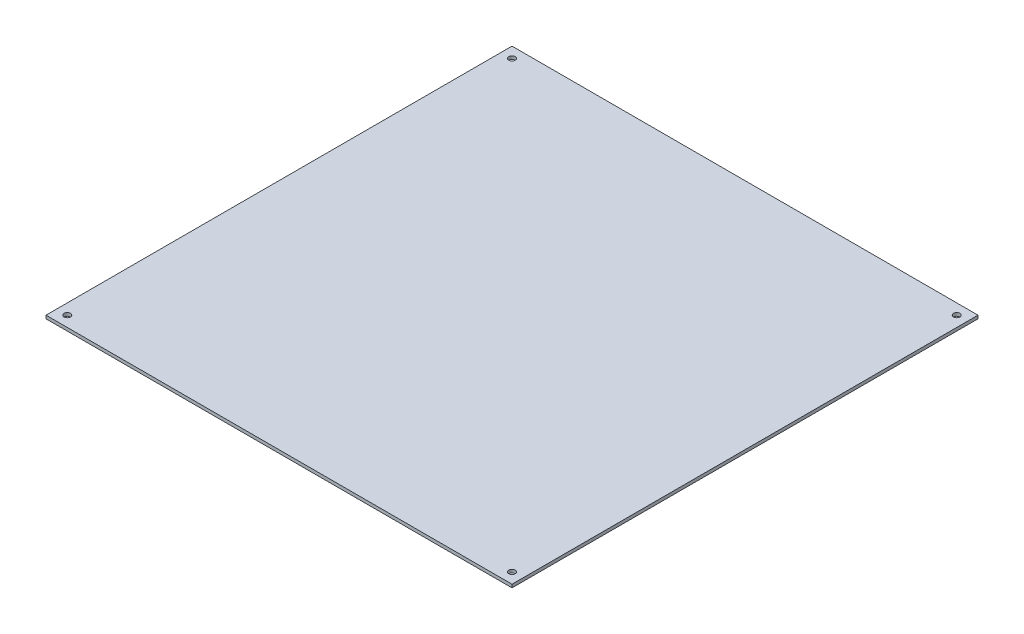
ISO-10303-21;
HEADER;
FILE_DESCRIPTION(('STEP AP214'),'2;1');
FILE_NAME('part.step','',(''),(''),'','','');
FILE_SCHEMA(('AUTOMOTIVE_DESIGN { 1 0 10303 214 1 1 1 1 }'));
ENDSEC;
DATA;
#1=APPLICATION_CONTEXT('core data for automotive mechanical design processes');
#2=APPLICATION_PROTOCOL_DEFINITION('international standard','automotive_design',2000,#1);
#3=PRODUCT_CONTEXT('',#1,'mechanical');
#4=PRODUCT('Part','Part','',(#3));
#5=PRODUCT_RELATED_PRODUCT_CATEGORY('part','',(#4));
#6=PRODUCT_DEFINITION_FORMATION('','',#4);
#7=PRODUCT_DEFINITION_CONTEXT('part definition',#1,'design');
#8=PRODUCT_DEFINITION('design','',#6,#7);
#9=PRODUCT_DEFINITION_SHAPE('','',#8);
#10=(LENGTH_UNIT() NAMED_UNIT(*) SI_UNIT(.MILLI.,.METRE.));
#11=(NAMED_UNIT(*) PLANE_ANGLE_UNIT() SI_UNIT($,.RADIAN.));
#12=(NAMED_UNIT(*) SI_UNIT($,.STERADIAN.) SOLID_ANGLE_UNIT());
#13=UNCERTAINTY_MEASURE_WITH_UNIT(LENGTH_MEASURE(1.E-05),#10,'distance_accuracy_value','');
#14=(GEOMETRIC_REPRESENTATION_CONTEXT(3) GLOBAL_UNCERTAINTY_ASSIGNED_CONTEXT((#13)) GLOBAL_UNIT_ASSIGNED_CONTEXT((#10,
#11,#12)) REPRESENTATION_CONTEXT('',''));
#15=CARTESIAN_POINT('',(0.,0.,0.));
#16=DIRECTION('',(0.,0.,1.));
#17=DIRECTION('',(1.,0.,0.));
#18=AXIS2_PLACEMENT_3D('',#15,#16,#17);
#19=CARTESIAN_POINT('',(0.,1.5,0.));
#20=DIRECTION('',(0.,1.,0.));
#21=DIRECTION('',(0.,0.,1.));
#22=AXIS2_PLACEMENT_3D('',#19,#20,#21);
#23=PLANE('',#22);
#24=CARTESIAN_POINT('',(-5.,1.5,-5.00000000000003));
#25=DIRECTION('',(0.,1.,0.));
#26=DIRECTION('',(0.,0.,1.));
#27=AXIS2_PLACEMENT_3D('',#24,#25,#26);
#28=CIRCLE('',#27,1.5);
#29=CARTESIAN_POINT('',(-5.,1.5,-3.50000000000003));
#30=VERTEX_POINT('',#29);
#31=EDGE_CURVE('E122',#30,#30,#28,.T.);
#32=ORIENTED_EDGE('',*,*,#31,.F.);
#33=EDGE_LOOP('',(#32));
#34=FACE_BOUND('',#33,.T.);
#35=CARTESIAN_POINT('',(-214.,1.5,-214.));
#36=DIRECTION('',(0.,1.,0.));
#37=DIRECTION('',(0.,0.,1.));
#38=AXIS2_PLACEMENT_3D('',#35,#36,#37);
#39=CIRCLE('',#38,1.5);
#40=CARTESIAN_POINT('',(-214.,1.5,-212.5));
#41=VERTEX_POINT('',#40);
#42=EDGE_CURVE('E101',#41,#41,#39,.T.);
#43=ORIENTED_EDGE('',*,*,#42,.F.);
#44=EDGE_LOOP('',(#43));
#45=FACE_BOUND('',#44,.T.);
#46=DIRECTION('',(0.,0.,1.));
#47=VECTOR('',#46,1.);
#48=CARTESIAN_POINT('',(-219.,1.5,-219.));
#49=LINE('',#48,#47);
#50=CARTESIAN_POINT('',(-219.,1.5,-219.));
#51=VERTEX_POINT('',#50);
#52=CARTESIAN_POINT('',(-219.,1.5,0.));
#53=VERTEX_POINT('',#52);
#54=EDGE_CURVE('E86',#51,#53,#49,.T.);
#55=ORIENTED_EDGE('',*,*,#54,.T.);
#56=DIRECTION('',(1.,0.,0.));
#57=VECTOR('',#56,1.);
#58=CARTESIAN_POINT('',(-219.,1.5,0.));
#59=LINE('',#58,#57);
#60=CARTESIAN_POINT('',(0.,1.5,0.));
#61=VERTEX_POINT('',#60);
#62=EDGE_CURVE('E81',#53,#61,#59,.T.);
#63=ORIENTED_EDGE('',*,*,#62,.T.);
#64=DIRECTION('',(0.,0.,-1.));
#65=VECTOR('',#64,1.);
#66=CARTESIAN_POINT('',(0.,1.5,-219.));
#67=LINE('',#66,#65);
#68=CARTESIAN_POINT('',(0.,1.5,-219.));
#69=VERTEX_POINT('',#68);
#70=EDGE_CURVE('E84',#61,#69,#67,.T.);
#71=ORIENTED_EDGE('',*,*,#70,.T.);
#72=DIRECTION('',(-1.,0.,0.));
#73=VECTOR('',#72,1.);
#74=CARTESIAN_POINT('',(-219.,1.5,-219.));
#75=LINE('',#74,#73);
#76=EDGE_CURVE('E51',#69,#51,#75,.T.);
#77=ORIENTED_EDGE('',*,*,#76,.T.);
#78=EDGE_LOOP('',(#55,#63,#71,#77));
#79=FACE_BOUND('',#78,.T.);
#80=CARTESIAN_POINT('',(-214.,1.5,-5.));
#81=DIRECTION('',(0.,1.,0.));
#82=DIRECTION('',(0.,0.,1.));
#83=AXIS2_PLACEMENT_3D('',#80,#81,#82);
#84=CIRCLE('',#83,1.5);
#85=CARTESIAN_POINT('',(-214.,1.5,-3.50000000000001));
#86=VERTEX_POINT('',#85);
#87=EDGE_CURVE('E116',#86,#86,#84,.T.);
#88=ORIENTED_EDGE('',*,*,#87,.F.);
#89=EDGE_LOOP('',(#88));
#90=FACE_BOUND('',#89,.T.);
#91=CARTESIAN_POINT('',(-5.00000000000006,1.5,-214.));
#92=DIRECTION('',(0.,1.,0.));
#93=DIRECTION('',(0.,0.,1.));
#94=AXIS2_PLACEMENT_3D('',#91,#92,#93);
#95=CIRCLE('',#94,1.5);
#96=CARTESIAN_POINT('',(-5.00000000000006,1.5,-212.5));
#97=VERTEX_POINT('',#96);
#98=EDGE_CURVE('E128',#97,#97,#95,.T.);
#99=ORIENTED_EDGE('',*,*,#98,.F.);
#100=EDGE_LOOP('',(#99));
#101=FACE_BOUND('',#100,.T.);
#102=ADVANCED_FACE('F34',(#34,#45,#79,#90,#101),#23,.T.);
#103=CARTESIAN_POINT('',(0.,0.,0.));
#104=DIRECTION('',(0.,1.,0.));
#105=DIRECTION('',(0.,0.,1.));
#106=AXIS2_PLACEMENT_3D('',#103,#104,#105);
#107=PLANE('',#106);
#108=DIRECTION('',(0.,0.,1.));
#109=VECTOR('',#108,1.);
#110=CARTESIAN_POINT('',(-219.,0.,-219.));
#111=LINE('',#110,#109);
#112=CARTESIAN_POINT('',(-219.,0.,-219.));
#113=VERTEX_POINT('',#112);
#114=CARTESIAN_POINT('',(-219.,0.,0.));
#115=VERTEX_POINT('',#114);
#116=EDGE_CURVE('E98',#113,#115,#111,.T.);
#117=ORIENTED_EDGE('',*,*,#116,.F.);
#118=DIRECTION('',(-1.,0.,0.));
#119=VECTOR('',#118,1.);
#120=CARTESIAN_POINT('',(-219.,0.,-219.));
#121=LINE('',#120,#119);
#122=CARTESIAN_POINT('',(0.,0.,-219.));
#123=VERTEX_POINT('',#122);
#124=EDGE_CURVE('E74',#123,#113,#121,.T.);
#125=ORIENTED_EDGE('',*,*,#124,.F.);
#126=DIRECTION('',(0.,0.,-1.));
#127=VECTOR('',#126,1.);
#128=CARTESIAN_POINT('',(0.,0.,-219.));
#129=LINE('',#128,#127);
#130=CARTESIAN_POINT('',(0.,0.,0.));
#131=VERTEX_POINT('',#130);
#132=EDGE_CURVE('E68',#131,#123,#129,.T.);
#133=ORIENTED_EDGE('',*,*,#132,.F.);
#134=DIRECTION('',(1.,0.,0.));
#135=VECTOR('',#134,1.);
#136=CARTESIAN_POINT('',(-219.,0.,0.));
#137=LINE('',#136,#135);
#138=EDGE_CURVE('E90',#115,#131,#137,.T.);
#139=ORIENTED_EDGE('',*,*,#138,.F.);
#140=EDGE_LOOP('',(#117,#125,#133,#139));
#141=FACE_BOUND('',#140,.T.);
#142=CARTESIAN_POINT('',(-214.,0.,-214.));
#143=DIRECTION('',(0.,1.,0.));
#144=DIRECTION('',(0.,0.,1.));
#145=AXIS2_PLACEMENT_3D('',#142,#143,#144);
#146=CIRCLE('',#145,1.5);
#147=CARTESIAN_POINT('',(-214.,0.,-212.5));
#148=VERTEX_POINT('',#147);
#149=EDGE_CURVE('E113',#148,#148,#146,.T.);
#150=ORIENTED_EDGE('',*,*,#149,.T.);
#151=EDGE_LOOP('',(#150));
#152=FACE_BOUND('',#151,.T.);
#153=CARTESIAN_POINT('',(-214.,0.,-5.));
#154=DIRECTION('',(0.,1.,0.));
#155=DIRECTION('',(0.,0.,1.));
#156=AXIS2_PLACEMENT_3D('',#153,#154,#155);
#157=CIRCLE('',#156,1.5);
#158=CARTESIAN_POINT('',(-214.,0.,-3.50000000000001));
#159=VERTEX_POINT('',#158);
#160=EDGE_CURVE('E119',#159,#159,#157,.T.);
#161=ORIENTED_EDGE('',*,*,#160,.T.);
#162=EDGE_LOOP('',(#161));
#163=FACE_BOUND('',#162,.T.);
#164=CARTESIAN_POINT('',(-5.,0.,-5.00000000000003));
#165=DIRECTION('',(0.,1.,0.));
#166=DIRECTION('',(0.,0.,1.));
#167=AXIS2_PLACEMENT_3D('',#164,#165,#166);
#168=CIRCLE('',#167,1.5);
#169=CARTESIAN_POINT('',(-5.,0.,-3.50000000000003));
#170=VERTEX_POINT('',#169);
#171=EDGE_CURVE('E125',#170,#170,#168,.T.);
#172=ORIENTED_EDGE('',*,*,#171,.T.);
#173=EDGE_LOOP('',(#172));
#174=FACE_BOUND('',#173,.T.);
#175=CARTESIAN_POINT('',(-5.00000000000006,0.,-214.));
#176=DIRECTION('',(0.,1.,0.));
#177=DIRECTION('',(0.,0.,1.));
#178=AXIS2_PLACEMENT_3D('',#175,#176,#177);
#179=CIRCLE('',#178,1.5);
#180=CARTESIAN_POINT('',(-5.00000000000006,0.,-212.5));
#181=VERTEX_POINT('',#180);
#182=EDGE_CURVE('E131',#181,#181,#179,.T.);
#183=ORIENTED_EDGE('',*,*,#182,.T.);
#184=EDGE_LOOP('',(#183));
#185=FACE_BOUND('',#184,.T.);
#186=ADVANCED_FACE('F109',(#141,#152,#163,#174,#185),#107,.F.);
#187=CARTESIAN_POINT('',(-219.,1.5,-219.));
#188=DIRECTION('',(1.,0.,0.));
#189=DIRECTION('',(0.,0.,-1.));
#190=AXIS2_PLACEMENT_3D('',#187,#188,#189);
#191=PLANE('',#190);
#192=ORIENTED_EDGE('',*,*,#116,.T.);
#193=DIRECTION('',(0.,-1.,0.));
#194=VECTOR('',#193,1.);
#195=CARTESIAN_POINT('',(-219.,1.5,0.));
#196=LINE('',#195,#194);
#197=EDGE_CURVE('E11',#53,#115,#196,.T.);
#198=ORIENTED_EDGE('',*,*,#197,.F.);
#199=ORIENTED_EDGE('',*,*,#54,.F.);
#200=DIRECTION('',(0.,-1.,0.));
#201=VECTOR('',#200,1.);
#202=CARTESIAN_POINT('',(-219.,1.5,-219.));
#203=LINE('',#202,#201);
#204=EDGE_CURVE('E94',#51,#113,#203,.T.);
#205=ORIENTED_EDGE('',*,*,#204,.T.);
#206=EDGE_LOOP('',(#192,#198,#199,#205));
#207=FACE_BOUND('',#206,.T.);
#208=ADVANCED_FACE('F36',(#207),#191,.F.);
#209=CARTESIAN_POINT('',(-219.,1.5,0.));
#210=DIRECTION('',(0.,0.,-1.));
#211=DIRECTION('',(-1.,0.,0.));
#212=AXIS2_PLACEMENT_3D('',#209,#210,#211);
#213=PLANE('',#212);
#214=ORIENTED_EDGE('',*,*,#138,.T.);
#215=DIRECTION('',(0.,-1.,0.));
#216=VECTOR('',#215,1.);
#217=CARTESIAN_POINT('',(0.,1.5,0.));
#218=LINE('',#217,#216);
#219=EDGE_CURVE('E43',#61,#131,#218,.T.);
#220=ORIENTED_EDGE('',*,*,#219,.F.);
#221=ORIENTED_EDGE('',*,*,#62,.F.);
#222=ORIENTED_EDGE('',*,*,#197,.T.);
#223=EDGE_LOOP('',(#214,#220,#221,#222));
#224=FACE_BOUND('',#223,.T.);
#225=ADVANCED_FACE('F89',(#224),#213,.F.);
#226=CARTESIAN_POINT('',(0.,1.5,-219.));
#227=DIRECTION('',(-1.,0.,0.));
#228=DIRECTION('',(0.,0.,1.));
#229=AXIS2_PLACEMENT_3D('',#226,#227,#228);
#230=PLANE('',#229);
#231=ORIENTED_EDGE('',*,*,#132,.T.);
#232=DIRECTION('',(0.,-1.,0.));
#233=VECTOR('',#232,1.);
#234=CARTESIAN_POINT('',(0.,1.5,-219.));
#235=LINE('',#234,#233);
#236=EDGE_CURVE('E91',#69,#123,#235,.T.);
#237=ORIENTED_EDGE('',*,*,#236,.F.);
#238=ORIENTED_EDGE('',*,*,#70,.F.);
#239=ORIENTED_EDGE('',*,*,#219,.T.);
#240=EDGE_LOOP('',(#231,#237,#238,#239));
#241=FACE_BOUND('',#240,.T.);
#242=ADVANCED_FACE('F92',(#241),#230,.F.);
#243=CARTESIAN_POINT('',(-219.,1.5,-219.));
#244=DIRECTION('',(0.,0.,1.));
#245=DIRECTION('',(1.,0.,0.));
#246=AXIS2_PLACEMENT_3D('',#243,#244,#245);
#247=PLANE('',#246);
#248=ORIENTED_EDGE('',*,*,#124,.T.);
#249=ORIENTED_EDGE('',*,*,#204,.F.);
#250=ORIENTED_EDGE('',*,*,#76,.F.);
#251=ORIENTED_EDGE('',*,*,#236,.T.);
#252=EDGE_LOOP('',(#248,#249,#250,#251));
#253=FACE_BOUND('',#252,.T.);
#254=ADVANCED_FACE('F106',(#253),#247,.F.);
#255=CARTESIAN_POINT('',(-214.,1.5,-214.));
#256=DIRECTION('',(0.,-1.,0.));
#257=DIRECTION('',(0.,0.,-1.));
#258=AXIS2_PLACEMENT_3D('',#255,#256,#257);
#259=CYLINDRICAL_SURFACE('',#258,1.5);
#260=ORIENTED_EDGE('',*,*,#42,.T.);
#261=EDGE_LOOP('',(#260));
#262=FACE_BOUND('',#261,.T.);
#263=ORIENTED_EDGE('',*,*,#149,.F.);
#264=EDGE_LOOP('',(#263));
#265=FACE_BOUND('',#264,.T.);
#266=ADVANCED_FACE('F150',(#262,#265),#259,.F.);
#267=CARTESIAN_POINT('',(-214.,1.5,-5.));
#268=DIRECTION('',(0.,-1.,0.));
#269=DIRECTION('',(0.,0.,-1.));
#270=AXIS2_PLACEMENT_3D('',#267,#268,#269);
#271=CYLINDRICAL_SURFACE('',#270,1.5);
#272=ORIENTED_EDGE('',*,*,#87,.T.);
#273=EDGE_LOOP('',(#272));
#274=FACE_BOUND('',#273,.T.);
#275=ORIENTED_EDGE('',*,*,#160,.F.);
#276=EDGE_LOOP('',(#275));
#277=FACE_BOUND('',#276,.T.);
#278=ADVANCED_FACE('F196',(#274,#277),#271,.F.);
#279=CARTESIAN_POINT('',(-5.,1.5,-5.00000000000003));
#280=DIRECTION('',(0.,-1.,0.));
#281=DIRECTION('',(0.,0.,-1.));
#282=AXIS2_PLACEMENT_3D('',#279,#280,#281);
#283=CYLINDRICAL_SURFACE('',#282,1.5);
#284=ORIENTED_EDGE('',*,*,#31,.T.);
#285=EDGE_LOOP('',(#284));
#286=FACE_BOUND('',#285,.T.);
#287=ORIENTED_EDGE('',*,*,#171,.F.);
#288=EDGE_LOOP('',(#287));
#289=FACE_BOUND('',#288,.T.);
#290=ADVANCED_FACE('F204',(#286,#289),#283,.F.);
#291=CARTESIAN_POINT('',(-5.00000000000006,1.5,-214.));
#292=DIRECTION('',(0.,-1.,0.));
#293=DIRECTION('',(0.,0.,-1.));
#294=AXIS2_PLACEMENT_3D('',#291,#292,#293);
#295=CYLINDRICAL_SURFACE('',#294,1.5);
#296=ORIENTED_EDGE('',*,*,#98,.T.);
#297=EDGE_LOOP('',(#296));
#298=FACE_BOUND('',#297,.T.);
#299=ORIENTED_EDGE('',*,*,#182,.F.);
#300=EDGE_LOOP('',(#299));
#301=FACE_BOUND('',#300,.T.);
#302=ADVANCED_FACE('F137',(#298,#301),#295,.F.);
#303=CLOSED_SHELL('',(#102,#186,#208,#225,#242,#254,#266,#278,#290,#302));
#304=MANIFOLD_SOLID_BREP('B2',#303);
#305=ADVANCED_BREP_SHAPE_REPRESENTATION('',(#18,#304),#14);
#306=SHAPE_DEFINITION_REPRESENTATION(#9,#305);
ENDSEC;
END-ISO-10303-21;
